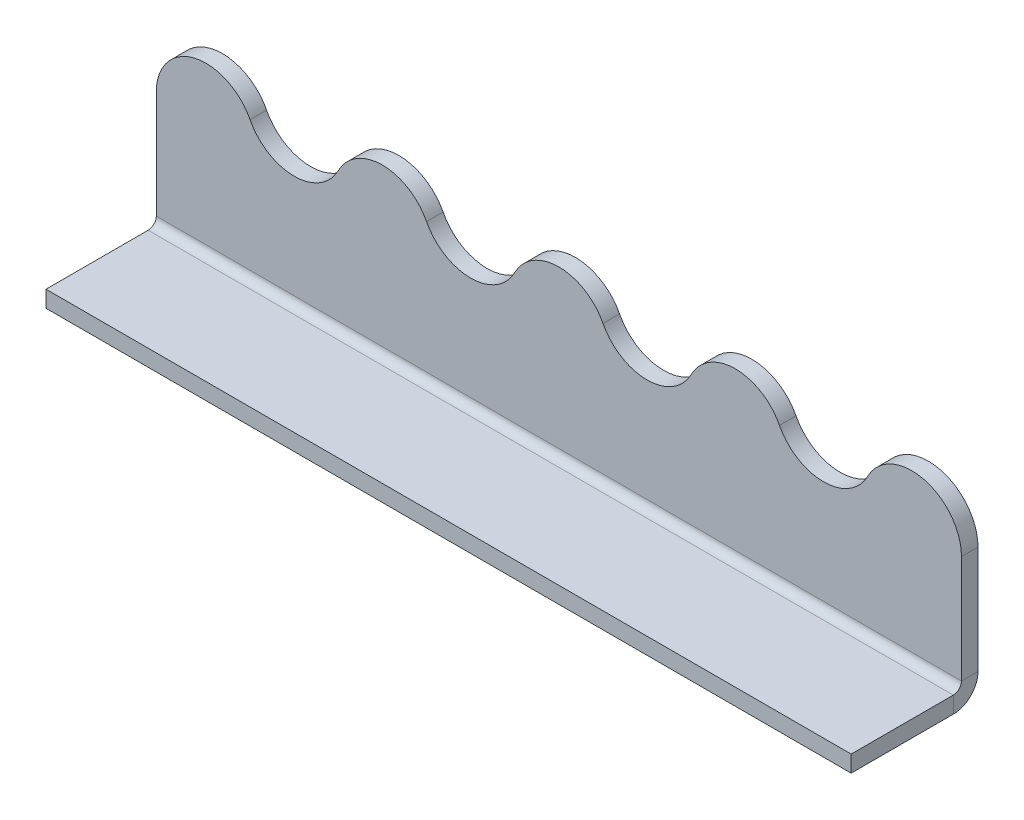
ISO-10303-21;
HEADER;
FILE_DESCRIPTION(('STEP AP214'),'2;1');
FILE_NAME('part.step','',(''),(''),'','','');
FILE_SCHEMA(('AUTOMOTIVE_DESIGN { 1 0 10303 214 1 1 1 1 }'));
ENDSEC;
DATA;
#1=APPLICATION_CONTEXT('core data for automotive mechanical design processes');
#2=APPLICATION_PROTOCOL_DEFINITION('international standard','automotive_design',2000,#1);
#3=PRODUCT_CONTEXT('',#1,'mechanical');
#4=PRODUCT('Part','Part','',(#3));
#5=PRODUCT_RELATED_PRODUCT_CATEGORY('part','',(#4));
#6=PRODUCT_DEFINITION_FORMATION('','',#4);
#7=PRODUCT_DEFINITION_CONTEXT('part definition',#1,'design');
#8=PRODUCT_DEFINITION('design','',#6,#7);
#9=PRODUCT_DEFINITION_SHAPE('','',#8);
#10=(LENGTH_UNIT() NAMED_UNIT(*) SI_UNIT(.MILLI.,.METRE.));
#11=(NAMED_UNIT(*) PLANE_ANGLE_UNIT() SI_UNIT($,.RADIAN.));
#12=(NAMED_UNIT(*) SI_UNIT($,.STERADIAN.) SOLID_ANGLE_UNIT());
#13=UNCERTAINTY_MEASURE_WITH_UNIT(LENGTH_MEASURE(1.E-05),#10,'distance_accuracy_value','');
#14=(GEOMETRIC_REPRESENTATION_CONTEXT(3) GLOBAL_UNCERTAINTY_ASSIGNED_CONTEXT((#13)) GLOBAL_UNIT_ASSIGNED_CONTEXT((#10,
#11,#12)) REPRESENTATION_CONTEXT('',''));
#15=CARTESIAN_POINT('',(0.,0.,0.));
#16=DIRECTION('',(0.,0.,1.));
#17=DIRECTION('',(1.,0.,0.));
#18=AXIS2_PLACEMENT_3D('',#15,#16,#17);
#19=CARTESIAN_POINT('',(36.5,10.5,-1.5));
#20=DIRECTION('',(1.,0.,0.));
#21=DIRECTION('',(0.,1.,0.));
#22=AXIS2_PLACEMENT_3D('',#19,#20,#21);
#23=PLANE('',#22);
#24=DIRECTION('',(0.,1.,0.));
#25=VECTOR('',#24,1.);
#26=CARTESIAN_POINT('',(36.5,10.5,0.));
#27=LINE('',#26,#25);
#28=CARTESIAN_POINT('',(36.5,0.740000000000001,0.));
#29=VERTEX_POINT('',#28);
#30=CARTESIAN_POINT('',(36.5,10.5,0.));
#31=VERTEX_POINT('',#30);
#32=EDGE_CURVE('E164',#29,#31,#27,.T.);
#33=ORIENTED_EDGE('',*,*,#32,.F.);
#34=DIRECTION('',(0.,0.,-1.));
#35=VECTOR('',#34,1.);
#36=CARTESIAN_POINT('',(36.5,0.740000000000219,0.));
#37=LINE('',#36,#35);
#38=CARTESIAN_POINT('',(36.5,0.74000000000022,-1.5));
#39=VERTEX_POINT('',#38);
#40=EDGE_CURVE('E247',#29,#39,#37,.T.);
#41=ORIENTED_EDGE('',*,*,#40,.T.);
#42=DIRECTION('',(0.,1.,0.));
#43=VECTOR('',#42,1.);
#44=CARTESIAN_POINT('',(36.5,10.5,-1.5));
#45=LINE('',#44,#43);
#46=CARTESIAN_POINT('',(36.5,10.5,-1.5));
#47=VERTEX_POINT('',#46);
#48=EDGE_CURVE('E281',#39,#47,#45,.T.);
#49=ORIENTED_EDGE('',*,*,#48,.T.);
#50=DIRECTION('',(0.,0.,1.));
#51=VECTOR('',#50,1.);
#52=CARTESIAN_POINT('',(36.5,10.5,-1.5));
#53=LINE('',#52,#51);
#54=EDGE_CURVE('E197',#47,#31,#53,.T.);
#55=ORIENTED_EDGE('',*,*,#54,.T.);
#56=EDGE_LOOP('',(#33,#41,#49,#55));
#57=FACE_BOUND('',#56,.T.);
#58=ADVANCED_FACE('F36',(#57),#23,.T.);
#59=CARTESIAN_POINT('',(-32.0000000000001,10.4999999999996,-1.5));
#60=DIRECTION('',(0.,0.,1.));
#61=DIRECTION('',(1.,0.,0.));
#62=AXIS2_PLACEMENT_3D('',#59,#60,#61);
#63=PLANE('',#62);
#64=DIRECTION('',(1.,0.,0.));
#65=VECTOR('',#64,1.);
#66=CARTESIAN_POINT('',(36.5,0.74000000000022,-1.5));
#67=LINE('',#66,#65);
#68=CARTESIAN_POINT('',(-36.5,0.739999999999786,-1.5));
#69=VERTEX_POINT('',#68);
#70=EDGE_CURVE('E301',#39,#69,#67,.F.);
#71=ORIENTED_EDGE('',*,*,#70,.T.);
#72=DIRECTION('',(0.,-1.,0.));
#73=VECTOR('',#72,1.);
#74=CARTESIAN_POINT('',(-36.5000000000001,10.4999999999996,-1.5));
#75=LINE('',#74,#73);
#76=CARTESIAN_POINT('',(-36.5000000000001,10.4999999999996,-1.5));
#77=VERTEX_POINT('',#76);
#78=EDGE_CURVE('E279',#77,#69,#75,.T.);
#79=ORIENTED_EDGE('',*,*,#78,.F.);
#80=CARTESIAN_POINT('',(-32.0000000000001,10.4999999999996,-1.5));
#81=DIRECTION('',(0.,0.,1.));
#82=DIRECTION('',(1.,0.,0.));
#83=AXIS2_PLACEMENT_3D('',#80,#81,#82);
#84=CIRCLE('',#83,4.50000000000009);
#85=CARTESIAN_POINT('',(-28.0000000000001,12.5615528128088,-1.5));
#86=VERTEX_POINT('',#85);
#87=EDGE_CURVE('E186',#86,#77,#84,.T.);
#88=ORIENTED_EDGE('',*,*,#87,.F.);
#89=CARTESIAN_POINT('',(-24.0000000000001,14.6231056256177,-1.5));
#90=DIRECTION('',(0.,0.,-1.));
#91=DIRECTION('',(-1.,0.,0.));
#92=AXIS2_PLACEMENT_3D('',#89,#90,#91);
#93=CIRCLE('',#92,4.5);
#94=CARTESIAN_POINT('',(-20.0000000000001,12.5615528128088,-1.5));
#95=VERTEX_POINT('',#94);
#96=EDGE_CURVE('E148',#95,#86,#93,.T.);
#97=ORIENTED_EDGE('',*,*,#96,.F.);
#98=CARTESIAN_POINT('',(-16.0000000000001,10.5,-1.5));
#99=DIRECTION('',(0.,0.,1.));
#100=DIRECTION('',(1.,0.,0.));
#101=AXIS2_PLACEMENT_3D('',#98,#99,#100);
#102=CIRCLE('',#101,4.5);
#103=CARTESIAN_POINT('',(-12.0000000000001,12.5615528128088,-1.5));
#104=VERTEX_POINT('',#103);
#105=EDGE_CURVE('E131',#104,#95,#102,.T.);
#106=ORIENTED_EDGE('',*,*,#105,.F.);
#107=CARTESIAN_POINT('',(-8.0000000000001,14.6231056256177,-1.5));
#108=DIRECTION('',(0.,0.,-1.));
#109=DIRECTION('',(-1.,0.,0.));
#110=AXIS2_PLACEMENT_3D('',#107,#108,#109);
#111=CIRCLE('',#110,4.5);
#112=CARTESIAN_POINT('',(-4.00000000000005,12.5615528128088,-1.5));
#113=VERTEX_POINT('',#112);
#114=EDGE_CURVE('E146',#113,#104,#111,.T.);
#115=ORIENTED_EDGE('',*,*,#114,.F.);
#116=CARTESIAN_POINT('',(0.,10.5,-1.5));
#117=DIRECTION('',(0.,0.,1.));
#118=DIRECTION('',(-1.,0.,0.));
#119=AXIS2_PLACEMENT_3D('',#116,#117,#118);
#120=CIRCLE('',#119,4.50000000000004);
#121=CARTESIAN_POINT('',(4.,12.5615528128088,-1.5));
#122=VERTEX_POINT('',#121);
#123=EDGE_CURVE('E151',#122,#113,#120,.T.);
#124=ORIENTED_EDGE('',*,*,#123,.F.);
#125=CARTESIAN_POINT('',(8.,14.6231056256177,-1.5));
#126=DIRECTION('',(0.,0.,-1.));
#127=DIRECTION('',(1.,0.,0.));
#128=AXIS2_PLACEMENT_3D('',#125,#126,#127);
#129=CIRCLE('',#128,4.5);
#130=CARTESIAN_POINT('',(12.,12.5615528128088,-1.5));
#131=VERTEX_POINT('',#130);
#132=EDGE_CURVE('E153',#131,#122,#129,.T.);
#133=ORIENTED_EDGE('',*,*,#132,.F.);
#134=CARTESIAN_POINT('',(16.,10.5,-1.5));
#135=DIRECTION('',(0.,0.,1.));
#136=DIRECTION('',(-1.,0.,0.));
#137=AXIS2_PLACEMENT_3D('',#134,#135,#136);
#138=CIRCLE('',#137,4.5);
#139=CARTESIAN_POINT('',(20.,12.5615528128088,-1.5));
#140=VERTEX_POINT('',#139);
#141=EDGE_CURVE('E288',#140,#131,#138,.T.);
#142=ORIENTED_EDGE('',*,*,#141,.F.);
#143=CARTESIAN_POINT('',(24.,14.6231056256177,-1.5));
#144=DIRECTION('',(0.,0.,-1.));
#145=DIRECTION('',(1.,0.,0.));
#146=AXIS2_PLACEMENT_3D('',#143,#144,#145);
#147=CIRCLE('',#146,4.5);
#148=CARTESIAN_POINT('',(28.,12.5615528128088,-1.5));
#149=VERTEX_POINT('',#148);
#150=EDGE_CURVE('E285',#149,#140,#147,.T.);
#151=ORIENTED_EDGE('',*,*,#150,.F.);
#152=CARTESIAN_POINT('',(32.,10.5,-1.5));
#153=DIRECTION('',(0.,0.,1.));
#154=DIRECTION('',(-1.,0.,0.));
#155=AXIS2_PLACEMENT_3D('',#152,#153,#154);
#156=CIRCLE('',#155,4.5);
#157=EDGE_CURVE('E283',#47,#149,#156,.T.);
#158=ORIENTED_EDGE('',*,*,#157,.F.);
#159=ORIENTED_EDGE('',*,*,#48,.F.);
#160=EDGE_LOOP('',(#71,#79,#88,#97,#106,#115,#124,#133,#142,#151,#158,#159));
#161=FACE_BOUND('',#160,.T.);
#162=ADVANCED_FACE('F144',(#161),#63,.F.);
#163=CARTESIAN_POINT('',(-32.0000000000001,10.4999999999996,0.));
#164=DIRECTION('',(0.,0.,1.));
#165=DIRECTION('',(1.,0.,0.));
#166=AXIS2_PLACEMENT_3D('',#163,#164,#165);
#167=PLANE('',#166);
#168=DIRECTION('',(0.,-1.,0.));
#169=VECTOR('',#168,1.);
#170=CARTESIAN_POINT('',(-36.5000000000001,10.4999999999996,0.));
#171=LINE('',#170,#169);
#172=CARTESIAN_POINT('',(-36.5000000000001,10.4999999999996,0.));
#173=VERTEX_POINT('',#172);
#174=CARTESIAN_POINT('',(-36.5,0.739999999999776,0.));
#175=VERTEX_POINT('',#174);
#176=EDGE_CURVE('E161',#173,#175,#171,.T.);
#177=ORIENTED_EDGE('',*,*,#176,.T.);
#178=DIRECTION('',(1.,0.,0.));
#179=VECTOR('',#178,1.);
#180=CARTESIAN_POINT('',(36.5,0.740000000000219,0.));
#181=LINE('',#180,#179);
#182=EDGE_CURVE('E53',#29,#175,#181,.F.);
#183=ORIENTED_EDGE('',*,*,#182,.F.);
#184=ORIENTED_EDGE('',*,*,#32,.T.);
#185=CARTESIAN_POINT('',(32.,10.5,0.));
#186=DIRECTION('',(0.,0.,1.));
#187=DIRECTION('',(-1.,0.,0.));
#188=AXIS2_PLACEMENT_3D('',#185,#186,#187);
#189=CIRCLE('',#188,4.5);
#190=CARTESIAN_POINT('',(28.,12.5615528128088,0.));
#191=VERTEX_POINT('',#190);
#192=EDGE_CURVE('E166',#31,#191,#189,.T.);
#193=ORIENTED_EDGE('',*,*,#192,.T.);
#194=CARTESIAN_POINT('',(24.,14.6231056256177,0.));
#195=DIRECTION('',(0.,0.,-1.));
#196=DIRECTION('',(1.,0.,0.));
#197=AXIS2_PLACEMENT_3D('',#194,#195,#196);
#198=CIRCLE('',#197,4.5);
#199=CARTESIAN_POINT('',(20.,12.5615528128088,0.));
#200=VERTEX_POINT('',#199);
#201=EDGE_CURVE('E169',#191,#200,#198,.T.);
#202=ORIENTED_EDGE('',*,*,#201,.T.);
#203=CARTESIAN_POINT('',(16.,10.5,0.));
#204=DIRECTION('',(0.,0.,1.));
#205=DIRECTION('',(-1.,0.,0.));
#206=AXIS2_PLACEMENT_3D('',#203,#204,#205);
#207=CIRCLE('',#206,4.5);
#208=CARTESIAN_POINT('',(12.,12.5615528128088,0.));
#209=VERTEX_POINT('',#208);
#210=EDGE_CURVE('E172',#200,#209,#207,.T.);
#211=ORIENTED_EDGE('',*,*,#210,.T.);
#212=CARTESIAN_POINT('',(8.,14.6231056256177,0.));
#213=DIRECTION('',(0.,0.,-1.));
#214=DIRECTION('',(1.,0.,0.));
#215=AXIS2_PLACEMENT_3D('',#212,#213,#214);
#216=CIRCLE('',#215,4.5);
#217=CARTESIAN_POINT('',(4.,12.5615528128088,0.));
#218=VERTEX_POINT('',#217);
#219=EDGE_CURVE('E175',#209,#218,#216,.T.);
#220=ORIENTED_EDGE('',*,*,#219,.T.);
#221=CARTESIAN_POINT('',(0.,10.5,0.));
#222=DIRECTION('',(0.,0.,1.));
#223=DIRECTION('',(-1.,0.,0.));
#224=AXIS2_PLACEMENT_3D('',#221,#222,#223);
#225=CIRCLE('',#224,4.50000000000004);
#226=CARTESIAN_POINT('',(-4.00000000000005,12.5615528128088,0.));
#227=VERTEX_POINT('',#226);
#228=EDGE_CURVE('E178',#218,#227,#225,.T.);
#229=ORIENTED_EDGE('',*,*,#228,.T.);
#230=CARTESIAN_POINT('',(-8.0000000000001,14.6231056256177,0.));
#231=DIRECTION('',(0.,0.,-1.));
#232=DIRECTION('',(-1.,0.,0.));
#233=AXIS2_PLACEMENT_3D('',#230,#231,#232);
#234=CIRCLE('',#233,4.5);
#235=CARTESIAN_POINT('',(-12.0000000000001,12.5615528128088,0.));
#236=VERTEX_POINT('',#235);
#237=EDGE_CURVE('E181',#227,#236,#234,.T.);
#238=ORIENTED_EDGE('',*,*,#237,.T.);
#239=CARTESIAN_POINT('',(-16.0000000000001,10.5,0.));
#240=DIRECTION('',(0.,0.,1.));
#241=DIRECTION('',(1.,0.,0.));
#242=AXIS2_PLACEMENT_3D('',#239,#240,#241);
#243=CIRCLE('',#242,4.5);
#244=CARTESIAN_POINT('',(-20.0000000000001,12.5615528128088,0.));
#245=VERTEX_POINT('',#244);
#246=EDGE_CURVE('E134',#236,#245,#243,.T.);
#247=ORIENTED_EDGE('',*,*,#246,.T.);
#248=CARTESIAN_POINT('',(-24.0000000000001,14.6231056256177,0.));
#249=DIRECTION('',(0.,0.,-1.));
#250=DIRECTION('',(-1.,0.,0.));
#251=AXIS2_PLACEMENT_3D('',#248,#249,#250);
#252=CIRCLE('',#251,4.5);
#253=CARTESIAN_POINT('',(-28.0000000000001,12.5615528128088,0.));
#254=VERTEX_POINT('',#253);
#255=EDGE_CURVE('E184',#245,#254,#252,.T.);
#256=ORIENTED_EDGE('',*,*,#255,.T.);
#257=CARTESIAN_POINT('',(-32.0000000000001,10.4999999999996,0.));
#258=DIRECTION('',(0.,0.,1.));
#259=DIRECTION('',(1.,0.,0.));
#260=AXIS2_PLACEMENT_3D('',#257,#258,#259);
#261=CIRCLE('',#260,4.50000000000009);
#262=EDGE_CURVE('E158',#254,#173,#261,.T.);
#263=ORIENTED_EDGE('',*,*,#262,.T.);
#264=EDGE_LOOP('',(#177,#183,#184,#193,#202,#211,#220,#229,#238,#247,#256,#263));
#265=FACE_BOUND('',#264,.T.);
#266=ADVANCED_FACE('F206',(#265),#167,.T.);
#267=CARTESIAN_POINT('',(-32.0000000000001,10.4999999999996,-1.5));
#268=DIRECTION('',(0.,0.,1.));
#269=DIRECTION('',(1.,0.,0.));
#270=AXIS2_PLACEMENT_3D('',#267,#268,#269);
#271=CYLINDRICAL_SURFACE('',#270,4.50000000000009);
#272=ORIENTED_EDGE('',*,*,#262,.F.);
#273=DIRECTION('',(0.,0.,1.));
#274=VECTOR('',#273,1.);
#275=CARTESIAN_POINT('',(-28.0000000000001,12.5615528128088,-1.5));
#276=LINE('',#275,#274);
#277=EDGE_CURVE('E11',#86,#254,#276,.T.);
#278=ORIENTED_EDGE('',*,*,#277,.F.);
#279=ORIENTED_EDGE('',*,*,#87,.T.);
#280=DIRECTION('',(0.,0.,1.));
#281=VECTOR('',#280,1.);
#282=CARTESIAN_POINT('',(-36.5000000000001,10.4999999999996,-1.5));
#283=LINE('',#282,#281);
#284=EDGE_CURVE('E40',#77,#173,#283,.T.);
#285=ORIENTED_EDGE('',*,*,#284,.T.);
#286=EDGE_LOOP('',(#272,#278,#279,#285));
#287=FACE_BOUND('',#286,.T.);
#288=ADVANCED_FACE('F38',(#287),#271,.T.);
#289=CARTESIAN_POINT('',(-24.0000000000001,14.6231056256177,-1.5));
#290=DIRECTION('',(0.,0.,1.));
#291=DIRECTION('',(1.,0.,0.));
#292=AXIS2_PLACEMENT_3D('',#289,#290,#291);
#293=CYLINDRICAL_SURFACE('',#292,4.5);
#294=ORIENTED_EDGE('',*,*,#255,.F.);
#295=DIRECTION('',(0.,0.,1.));
#296=VECTOR('',#295,1.);
#297=CARTESIAN_POINT('',(-20.0000000000001,12.5615528128088,-1.5));
#298=LINE('',#297,#296);
#299=EDGE_CURVE('E45',#95,#245,#298,.T.);
#300=ORIENTED_EDGE('',*,*,#299,.F.);
#301=ORIENTED_EDGE('',*,*,#96,.T.);
#302=ORIENTED_EDGE('',*,*,#277,.T.);
#303=EDGE_LOOP('',(#294,#300,#301,#302));
#304=FACE_BOUND('',#303,.T.);
#305=ADVANCED_FACE('F207',(#304),#293,.F.);
#306=CARTESIAN_POINT('',(-16.0000000000001,10.5,-1.5));
#307=DIRECTION('',(0.,0.,1.));
#308=DIRECTION('',(1.,0.,0.));
#309=AXIS2_PLACEMENT_3D('',#306,#307,#308);
#310=CYLINDRICAL_SURFACE('',#309,4.5);
#311=ORIENTED_EDGE('',*,*,#246,.F.);
#312=DIRECTION('',(0.,0.,1.));
#313=VECTOR('',#312,1.);
#314=CARTESIAN_POINT('',(-12.0000000000001,12.5615528128088,-1.5));
#315=LINE('',#314,#313);
#316=EDGE_CURVE('E128',#104,#236,#315,.T.);
#317=ORIENTED_EDGE('',*,*,#316,.F.);
#318=ORIENTED_EDGE('',*,*,#105,.T.);
#319=ORIENTED_EDGE('',*,*,#299,.T.);
#320=EDGE_LOOP('',(#311,#317,#318,#319));
#321=FACE_BOUND('',#320,.T.);
#322=ADVANCED_FACE('F130',(#321),#310,.T.);
#323=CARTESIAN_POINT('',(-8.0000000000001,14.6231056256177,-1.5));
#324=DIRECTION('',(0.,0.,1.));
#325=DIRECTION('',(1.,0.,0.));
#326=AXIS2_PLACEMENT_3D('',#323,#324,#325);
#327=CYLINDRICAL_SURFACE('',#326,4.5);
#328=ORIENTED_EDGE('',*,*,#237,.F.);
#329=DIRECTION('',(0.,0.,1.));
#330=VECTOR('',#329,1.);
#331=CARTESIAN_POINT('',(-4.00000000000005,12.5615528128088,-1.5));
#332=LINE('',#331,#330);
#333=EDGE_CURVE('E139',#113,#227,#332,.T.);
#334=ORIENTED_EDGE('',*,*,#333,.F.);
#335=ORIENTED_EDGE('',*,*,#114,.T.);
#336=ORIENTED_EDGE('',*,*,#316,.T.);
#337=EDGE_LOOP('',(#328,#334,#335,#336));
#338=FACE_BOUND('',#337,.T.);
#339=ADVANCED_FACE('F150',(#338),#327,.F.);
#340=CARTESIAN_POINT('',(0.,10.5,-1.5));
#341=DIRECTION('',(0.,0.,1.));
#342=DIRECTION('',(1.,0.,0.));
#343=AXIS2_PLACEMENT_3D('',#340,#341,#342);
#344=CYLINDRICAL_SURFACE('',#343,4.50000000000004);
#345=ORIENTED_EDGE('',*,*,#228,.F.);
#346=DIRECTION('',(0.,0.,1.));
#347=VECTOR('',#346,1.);
#348=CARTESIAN_POINT('',(4.,12.5615528128088,-1.5));
#349=LINE('',#348,#347);
#350=EDGE_CURVE('E190',#122,#218,#349,.T.);
#351=ORIENTED_EDGE('',*,*,#350,.F.);
#352=ORIENTED_EDGE('',*,*,#123,.T.);
#353=ORIENTED_EDGE('',*,*,#333,.T.);
#354=EDGE_LOOP('',(#345,#351,#352,#353));
#355=FACE_BOUND('',#354,.T.);
#356=ADVANCED_FACE('F421',(#355),#344,.T.);
#357=CARTESIAN_POINT('',(8.,14.6231056256177,-1.5));
#358=DIRECTION('',(0.,0.,1.));
#359=DIRECTION('',(1.,0.,0.));
#360=AXIS2_PLACEMENT_3D('',#357,#358,#359);
#361=CYLINDRICAL_SURFACE('',#360,4.5);
#362=ORIENTED_EDGE('',*,*,#219,.F.);
#363=DIRECTION('',(0.,0.,1.));
#364=VECTOR('',#363,1.);
#365=CARTESIAN_POINT('',(12.,12.5615528128088,-1.5));
#366=LINE('',#365,#364);
#367=EDGE_CURVE('E192',#131,#209,#366,.T.);
#368=ORIENTED_EDGE('',*,*,#367,.F.);
#369=ORIENTED_EDGE('',*,*,#132,.T.);
#370=ORIENTED_EDGE('',*,*,#350,.T.);
#371=EDGE_LOOP('',(#362,#368,#369,#370));
#372=FACE_BOUND('',#371,.T.);
#373=ADVANCED_FACE('F294',(#372),#361,.F.);
#374=CARTESIAN_POINT('',(16.,10.5,-1.5));
#375=DIRECTION('',(0.,0.,1.));
#376=DIRECTION('',(1.,0.,0.));
#377=AXIS2_PLACEMENT_3D('',#374,#375,#376);
#378=CYLINDRICAL_SURFACE('',#377,4.5);
#379=ORIENTED_EDGE('',*,*,#210,.F.);
#380=DIRECTION('',(0.,0.,1.));
#381=VECTOR('',#380,1.);
#382=CARTESIAN_POINT('',(20.,12.5615528128088,-1.5));
#383=LINE('',#382,#381);
#384=EDGE_CURVE('E194',#140,#200,#383,.T.);
#385=ORIENTED_EDGE('',*,*,#384,.F.);
#386=ORIENTED_EDGE('',*,*,#141,.T.);
#387=ORIENTED_EDGE('',*,*,#367,.T.);
#388=EDGE_LOOP('',(#379,#385,#386,#387));
#389=FACE_BOUND('',#388,.T.);
#390=ADVANCED_FACE('F239',(#389),#378,.T.);
#391=CARTESIAN_POINT('',(24.,14.6231056256177,-1.5));
#392=DIRECTION('',(0.,0.,1.));
#393=DIRECTION('',(1.,0.,0.));
#394=AXIS2_PLACEMENT_3D('',#391,#392,#393);
#395=CYLINDRICAL_SURFACE('',#394,4.5);
#396=ORIENTED_EDGE('',*,*,#201,.F.);
#397=DIRECTION('',(0.,0.,1.));
#398=VECTOR('',#397,1.);
#399=CARTESIAN_POINT('',(28.,12.5615528128088,-1.5));
#400=LINE('',#399,#398);
#401=EDGE_CURVE('E196',#149,#191,#400,.T.);
#402=ORIENTED_EDGE('',*,*,#401,.F.);
#403=ORIENTED_EDGE('',*,*,#150,.T.);
#404=ORIENTED_EDGE('',*,*,#384,.T.);
#405=EDGE_LOOP('',(#396,#402,#403,#404));
#406=FACE_BOUND('',#405,.T.);
#407=ADVANCED_FACE('F234',(#406),#395,.F.);
#408=CARTESIAN_POINT('',(32.,10.5,-1.5));
#409=DIRECTION('',(0.,0.,1.));
#410=DIRECTION('',(1.,0.,0.));
#411=AXIS2_PLACEMENT_3D('',#408,#409,#410);
#412=CYLINDRICAL_SURFACE('',#411,4.5);
#413=ORIENTED_EDGE('',*,*,#192,.F.);
#414=ORIENTED_EDGE('',*,*,#54,.F.);
#415=ORIENTED_EDGE('',*,*,#157,.T.);
#416=ORIENTED_EDGE('',*,*,#401,.T.);
#417=EDGE_LOOP('',(#413,#414,#415,#416));
#418=FACE_BOUND('',#417,.T.);
#419=ADVANCED_FACE('F223',(#418),#412,.T.);
#420=CARTESIAN_POINT('',(-36.5000000000001,10.4999999999996,-1.5));
#421=DIRECTION('',(-1.,0.,0.));
#422=DIRECTION('',(0.,-1.,0.));
#423=AXIS2_PLACEMENT_3D('',#420,#421,#422);
#424=PLANE('',#423);
#425=DIRECTION('',(0.,0.,-1.));
#426=VECTOR('',#425,1.);
#427=CARTESIAN_POINT('',(-36.5,0.739999999999776,0.));
#428=LINE('',#427,#426);
#429=EDGE_CURVE('E162',#175,#69,#428,.T.);
#430=ORIENTED_EDGE('',*,*,#429,.F.);
#431=ORIENTED_EDGE('',*,*,#176,.F.);
#432=ORIENTED_EDGE('',*,*,#284,.F.);
#433=ORIENTED_EDGE('',*,*,#78,.T.);
#434=EDGE_LOOP('',(#430,#431,#432,#433));
#435=FACE_BOUND('',#434,.T.);
#436=ADVANCED_FACE('F203',(#435),#424,.T.);
#437=CARTESIAN_POINT('',(-36.5,0.739999999999775,0.740000000000002));
#438=DIRECTION('',(-1.,0.,0.));
#439=DIRECTION('',(0.,-1.,0.));
#440=AXIS2_PLACEMENT_3D('',#437,#438,#439);
#441=PLANE('',#440);
#442=DIRECTION('',(0.,-1.,0.));
#443=VECTOR('',#442,1.);
#444=CARTESIAN_POINT('',(-36.5,-2.24628301115776E-13,0.739999999999997));
#445=LINE('',#444,#443);
#446=CARTESIAN_POINT('',(-36.5,-2.24755110356245E-13,0.739999999999999));
#447=VERTEX_POINT('',#446);
#448=CARTESIAN_POINT('',(-36.5,-1.50000000000022,0.739999999999994));
#449=VERTEX_POINT('',#448);
#450=EDGE_CURVE('E314',#447,#449,#445,.T.);
#451=ORIENTED_EDGE('',*,*,#450,.F.);
#452=CARTESIAN_POINT('',(-36.5,0.739999999999775,0.740000000000002));
#453=DIRECTION('',(1.,0.,0.));
#454=DIRECTION('',(0.,1.,0.));
#455=AXIS2_PLACEMENT_3D('',#452,#453,#454);
#456=CIRCLE('',#455,0.74);
#457=EDGE_CURVE('E270',#175,#447,#456,.F.);
#458=ORIENTED_EDGE('',*,*,#457,.F.);
#459=ORIENTED_EDGE('',*,*,#429,.T.);
#460=CARTESIAN_POINT('',(-36.5,0.739999999999775,0.740000000000002));
#461=DIRECTION('',(1.,0.,0.));
#462=DIRECTION('',(0.,1.,0.));
#463=AXIS2_PLACEMENT_3D('',#460,#461,#462);
#464=CIRCLE('',#463,2.24);
#465=EDGE_CURVE('E259',#69,#449,#464,.F.);
#466=ORIENTED_EDGE('',*,*,#465,.T.);
#467=EDGE_LOOP('',(#451,#458,#459,#466));
#468=FACE_BOUND('',#467,.T.);
#469=ADVANCED_FACE('F226',(#468),#441,.T.);
#470=CARTESIAN_POINT('',(36.5,0.740000000000219,0.740000000000002));
#471=DIRECTION('',(-1.,0.,0.));
#472=DIRECTION('',(0.,-1.,0.));
#473=AXIS2_PLACEMENT_3D('',#470,#471,#472);
#474=PLANE('',#473);
#475=CARTESIAN_POINT('',(36.5,0.740000000000219,0.740000000000002));
#476=DIRECTION('',(1.,0.,0.));
#477=DIRECTION('',(0.,1.,0.));
#478=AXIS2_PLACEMENT_3D('',#475,#476,#477);
#479=CIRCLE('',#478,0.74);
#480=CARTESIAN_POINT('',(36.5,2.1911725905932E-13,0.739999999999999));
#481=VERTEX_POINT('',#480);
#482=EDGE_CURVE('E255',#481,#29,#479,.T.);
#483=ORIENTED_EDGE('',*,*,#482,.F.);
#484=DIRECTION('',(0.,-1.,0.));
#485=VECTOR('',#484,1.);
#486=CARTESIAN_POINT('',(36.5,2.19460908734287E-13,0.74));
#487=LINE('',#486,#485);
#488=CARTESIAN_POINT('',(36.5,-1.5,0.739999999999995));
#489=VERTEX_POINT('',#488);
#490=EDGE_CURVE('E354',#481,#489,#487,.T.);
#491=ORIENTED_EDGE('',*,*,#490,.T.);
#492=CARTESIAN_POINT('',(36.5,0.740000000000219,0.740000000000002));
#493=DIRECTION('',(1.,0.,0.));
#494=DIRECTION('',(0.,1.,0.));
#495=AXIS2_PLACEMENT_3D('',#492,#493,#494);
#496=CIRCLE('',#495,2.24);
#497=EDGE_CURVE('E258',#489,#39,#496,.T.);
#498=ORIENTED_EDGE('',*,*,#497,.T.);
#499=ORIENTED_EDGE('',*,*,#40,.F.);
#500=EDGE_LOOP('',(#483,#491,#498,#499));
#501=FACE_BOUND('',#500,.T.);
#502=ADVANCED_FACE('F231',(#501),#474,.F.);
#503=CARTESIAN_POINT('',(36.5,0.740000000000219,0.740000000000002));
#504=DIRECTION('',(1.,0.,0.));
#505=DIRECTION('',(0.,-1.,0.));
#506=AXIS2_PLACEMENT_3D('',#503,#504,#505);
#507=CYLINDRICAL_SURFACE('',#506,2.24);
#508=ORIENTED_EDGE('',*,*,#70,.F.);
#509=ORIENTED_EDGE('',*,*,#497,.F.);
#510=DIRECTION('',(-1.,0.,0.));
#511=VECTOR('',#510,1.);
#512=CARTESIAN_POINT('',(0.,-1.5,0.739999999999994));
#513=LINE('',#512,#511);
#514=EDGE_CURVE('E351',#489,#449,#513,.T.);
#515=ORIENTED_EDGE('',*,*,#514,.T.);
#516=ORIENTED_EDGE('',*,*,#465,.F.);
#517=EDGE_LOOP('',(#508,#509,#515,#516));
#518=FACE_BOUND('',#517,.T.);
#519=ADVANCED_FACE('F363',(#518),#507,.T.);
#520=CARTESIAN_POINT('',(36.5,0.740000000000219,0.740000000000002));
#521=DIRECTION('',(1.,0.,0.));
#522=DIRECTION('',(0.,-1.,0.));
#523=AXIS2_PLACEMENT_3D('',#520,#521,#522);
#524=CYLINDRICAL_SURFACE('',#523,0.74);
#525=ORIENTED_EDGE('',*,*,#182,.T.);
#526=ORIENTED_EDGE('',*,*,#457,.T.);
#527=DIRECTION('',(1.,0.,0.));
#528=VECTOR('',#527,1.);
#529=CARTESIAN_POINT('',(-36.5,-2.24628301115776E-13,0.739999999999997));
#530=LINE('',#529,#528);
#531=EDGE_CURVE('E267',#447,#481,#530,.T.);
#532=ORIENTED_EDGE('',*,*,#531,.T.);
#533=ORIENTED_EDGE('',*,*,#482,.T.);
#534=EDGE_LOOP('',(#525,#526,#532,#533));
#535=FACE_BOUND('',#534,.T.);
#536=ADVANCED_FACE('F263',(#535),#524,.F.);
#537=CARTESIAN_POINT('',(-36.5,-1.50000000000022,0.));
#538=DIRECTION('',(1.,0.,0.));
#539=DIRECTION('',(0.,1.,0.));
#540=AXIS2_PLACEMENT_3D('',#537,#538,#539);
#541=PLANE('',#540);
#542=ORIENTED_EDGE('',*,*,#450,.T.);
#543=DIRECTION('',(0.,0.,-1.));
#544=VECTOR('',#543,1.);
#545=CARTESIAN_POINT('',(-36.5,-1.50000000000022,0.));
#546=LINE('',#545,#544);
#547=CARTESIAN_POINT('',(-36.5,-1.50000000000026,9.99999999999999));
#548=VERTEX_POINT('',#547);
#549=EDGE_CURVE('E342',#548,#449,#546,.T.);
#550=ORIENTED_EDGE('',*,*,#549,.F.);
#551=DIRECTION('',(0.,1.,0.));
#552=VECTOR('',#551,1.);
#553=CARTESIAN_POINT('',(-36.5,-1.50000000000026,9.99999999999999));
#554=LINE('',#553,#552);
#555=CARTESIAN_POINT('',(-36.5,-2.56959418313463E-13,10.));
#556=VERTEX_POINT('',#555);
#557=EDGE_CURVE('E273',#548,#556,#554,.T.);
#558=ORIENTED_EDGE('',*,*,#557,.T.);
#559=DIRECTION('',(0.,0.,-1.));
#560=VECTOR('',#559,1.);
#561=CARTESIAN_POINT('',(-36.5,-2.22044604925031E-13,0.));
#562=LINE('',#561,#560);
#563=EDGE_CURVE('E348',#556,#447,#562,.T.);
#564=ORIENTED_EDGE('',*,*,#563,.T.);
#565=EDGE_LOOP('',(#542,#550,#558,#564));
#566=FACE_BOUND('',#565,.T.);
#567=ADVANCED_FACE('F347',(#566),#541,.F.);
#568=CARTESIAN_POINT('',(36.5,-1.49999999999981,9.99999999999999));
#569=DIRECTION('',(-1.,0.,0.));
#570=DIRECTION('',(0.,-1.,0.));
#571=AXIS2_PLACEMENT_3D('',#568,#569,#570);
#572=PLANE('',#571);
#573=ORIENTED_EDGE('',*,*,#490,.F.);
#574=DIRECTION('',(0.,0.,1.));
#575=VECTOR('',#574,1.);
#576=CARTESIAN_POINT('',(36.5,1.871297915366E-13,10.));
#577=LINE('',#576,#575);
#578=CARTESIAN_POINT('',(36.5,1.871297915366E-13,10.));
#579=VERTEX_POINT('',#578);
#580=EDGE_CURVE('E343',#481,#579,#577,.T.);
#581=ORIENTED_EDGE('',*,*,#580,.T.);
#582=DIRECTION('',(0.,1.,0.));
#583=VECTOR('',#582,1.);
#584=CARTESIAN_POINT('',(36.5,-1.49999999999981,9.99999999999999));
#585=LINE('',#584,#583);
#586=CARTESIAN_POINT('',(36.5,-1.49999999999981,9.99999999999999));
#587=VERTEX_POINT('',#586);
#588=EDGE_CURVE('E268',#587,#579,#585,.T.);
#589=ORIENTED_EDGE('',*,*,#588,.F.);
#590=DIRECTION('',(0.,0.,1.));
#591=VECTOR('',#590,1.);
#592=CARTESIAN_POINT('',(36.5,-1.49999999999981,9.99999999999999));
#593=LINE('',#592,#591);
#594=EDGE_CURVE('E367',#489,#587,#593,.T.);
#595=ORIENTED_EDGE('',*,*,#594,.F.);
#596=EDGE_LOOP('',(#573,#581,#589,#595));
#597=FACE_BOUND('',#596,.T.);
#598=ADVANCED_FACE('F369',(#597),#572,.F.);
#599=CARTESIAN_POINT('',(0.,-1.5,0.));
#600=DIRECTION('',(0.,1.,0.));
#601=DIRECTION('',(-1.,0.,0.));
#602=AXIS2_PLACEMENT_3D('',#599,#600,#601);
#603=PLANE('',#602);
#604=ORIENTED_EDGE('',*,*,#514,.F.);
#605=ORIENTED_EDGE('',*,*,#594,.T.);
#606=DIRECTION('',(-1.,0.,0.));
#607=VECTOR('',#606,1.);
#608=CARTESIAN_POINT('',(-36.5,-1.50000000000026,9.99999999999999));
#609=LINE('',#608,#607);
#610=EDGE_CURVE('E322',#587,#548,#609,.T.);
#611=ORIENTED_EDGE('',*,*,#610,.T.);
#612=ORIENTED_EDGE('',*,*,#549,.T.);
#613=EDGE_LOOP('',(#604,#605,#611,#612));
#614=FACE_BOUND('',#613,.T.);
#615=ADVANCED_FACE('F366',(#614),#603,.F.);
#616=CARTESIAN_POINT('',(0.,0.,0.));
#617=DIRECTION('',(0.,1.,0.));
#618=DIRECTION('',(-1.,0.,0.));
#619=AXIS2_PLACEMENT_3D('',#616,#617,#618);
#620=PLANE('',#619);
#621=ORIENTED_EDGE('',*,*,#580,.F.);
#622=ORIENTED_EDGE('',*,*,#531,.F.);
#623=ORIENTED_EDGE('',*,*,#563,.F.);
#624=DIRECTION('',(-1.,0.,0.));
#625=VECTOR('',#624,1.);
#626=CARTESIAN_POINT('',(-36.5,-2.56959418313463E-13,10.));
#627=LINE('',#626,#625);
#628=EDGE_CURVE('E334',#579,#556,#627,.T.);
#629=ORIENTED_EDGE('',*,*,#628,.F.);
#630=EDGE_LOOP('',(#621,#622,#623,#629));
#631=FACE_BOUND('',#630,.T.);
#632=ADVANCED_FACE('F350',(#631),#620,.T.);
#633=CARTESIAN_POINT('',(-36.5,-1.50000000000026,9.99999999999999));
#634=DIRECTION('',(0.,0.,-1.));
#635=DIRECTION('',(0.,1.,0.));
#636=AXIS2_PLACEMENT_3D('',#633,#634,#635);
#637=PLANE('',#636);
#638=ORIENTED_EDGE('',*,*,#628,.T.);
#639=ORIENTED_EDGE('',*,*,#557,.F.);
#640=ORIENTED_EDGE('',*,*,#610,.F.);
#641=ORIENTED_EDGE('',*,*,#588,.T.);
#642=EDGE_LOOP('',(#638,#639,#640,#641));
#643=FACE_BOUND('',#642,.T.);
#644=ADVANCED_FACE('F336',(#643),#637,.F.);
#645=CLOSED_SHELL('',(#58,#162,#266,#288,#305,#322,#339,#356,#373,#390,#407,#419,#436,#469,#502,
#519,#536,#567,#598,#615,#632,#644));
#646=MANIFOLD_SOLID_BREP('B2',#645);
#647=ADVANCED_BREP_SHAPE_REPRESENTATION('',(#18,#646),#14);
#648=SHAPE_DEFINITION_REPRESENTATION(#9,#647);
ENDSEC;
END-ISO-10303-21;
